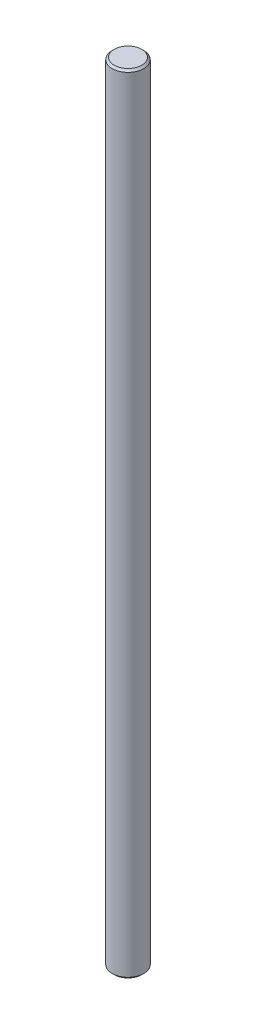
ISO-10303-21;
HEADER;
FILE_DESCRIPTION(('STEP AP214'),'2;1');
FILE_NAME('part.step','',(''),(''),'','','');
FILE_SCHEMA(('AUTOMOTIVE_DESIGN { 1 0 10303 214 1 1 1 1 }'));
ENDSEC;
DATA;
#1=APPLICATION_CONTEXT('core data for automotive mechanical design processes');
#2=APPLICATION_PROTOCOL_DEFINITION('international standard','automotive_design',2000,#1);
#3=PRODUCT_CONTEXT('',#1,'mechanical');
#4=PRODUCT('Part','Part','',(#3));
#5=PRODUCT_RELATED_PRODUCT_CATEGORY('part','',(#4));
#6=PRODUCT_DEFINITION_FORMATION('','',#4);
#7=PRODUCT_DEFINITION_CONTEXT('part definition',#1,'design');
#8=PRODUCT_DEFINITION('design','',#6,#7);
#9=PRODUCT_DEFINITION_SHAPE('','',#8);
#10=(LENGTH_UNIT() NAMED_UNIT(*) SI_UNIT(.MILLI.,.METRE.));
#11=(NAMED_UNIT(*) PLANE_ANGLE_UNIT() SI_UNIT($,.RADIAN.));
#12=(NAMED_UNIT(*) SI_UNIT($,.STERADIAN.) SOLID_ANGLE_UNIT());
#13=UNCERTAINTY_MEASURE_WITH_UNIT(LENGTH_MEASURE(1.E-05),#10,'distance_accuracy_value','');
#14=(GEOMETRIC_REPRESENTATION_CONTEXT(3) GLOBAL_UNCERTAINTY_ASSIGNED_CONTEXT((#13)) GLOBAL_UNIT_ASSIGNED_CONTEXT((#10,
#11,#12)) REPRESENTATION_CONTEXT('',''));
#15=CARTESIAN_POINT('',(0.,0.,0.));
#16=DIRECTION('',(0.,0.,1.));
#17=DIRECTION('',(1.,0.,0.));
#18=AXIS2_PLACEMENT_3D('',#15,#16,#17);
#19=CARTESIAN_POINT('',(0.,50.,0.));
#20=DIRECTION('',(0.,-1.,0.));
#21=DIRECTION('',(0.,0.,-1.));
#22=AXIS2_PLACEMENT_3D('',#19,#20,#21);
#23=CYLINDRICAL_SURFACE('',#22,2.);
#24=CARTESIAN_POINT('',(0.,-49.75,0.));
#25=DIRECTION('',(0.,1.,0.));
#26=DIRECTION('',(0.,0.,1.));
#27=AXIS2_PLACEMENT_3D('',#24,#25,#26);
#28=CIRCLE('',#27,2.);
#29=CARTESIAN_POINT('',(0.,-49.75,2.));
#30=VERTEX_POINT('',#29);
#31=EDGE_CURVE('E57',#30,#30,#28,.T.);
#32=ORIENTED_EDGE('',*,*,#31,.T.);
#33=EDGE_LOOP('',(#32));
#34=FACE_BOUND('',#33,.T.);
#35=CARTESIAN_POINT('',(0.,49.75,0.));
#36=DIRECTION('',(0.,1.,0.));
#37=DIRECTION('',(0.,0.,1.));
#38=AXIS2_PLACEMENT_3D('',#35,#36,#37);
#39=CIRCLE('',#38,2.);
#40=CARTESIAN_POINT('',(0.,49.75,2.));
#41=VERTEX_POINT('',#40);
#42=EDGE_CURVE('E62',#41,#41,#39,.F.);
#43=ORIENTED_EDGE('',*,*,#42,.T.);
#44=EDGE_LOOP('',(#43));
#45=FACE_BOUND('',#44,.T.);
#46=ADVANCED_FACE('F43',(#34,#45),#23,.T.);
#47=CARTESIAN_POINT('',(0.,50.,0.));
#48=DIRECTION('',(0.,1.,0.));
#49=DIRECTION('',(0.,0.,1.));
#50=AXIS2_PLACEMENT_3D('',#47,#48,#49);
#51=PLANE('',#50);
#52=CARTESIAN_POINT('',(0.,50.,0.));
#53=DIRECTION('',(0.,1.,0.));
#54=DIRECTION('',(0.,0.,1.));
#55=AXIS2_PLACEMENT_3D('',#52,#53,#54);
#56=CIRCLE('',#55,1.75);
#57=CARTESIAN_POINT('',(0.,50.,1.75));
#58=VERTEX_POINT('',#57);
#59=EDGE_CURVE('E10',#58,#58,#56,.T.);
#60=ORIENTED_EDGE('',*,*,#59,.T.);
#61=EDGE_LOOP('',(#60));
#62=FACE_BOUND('',#61,.T.);
#63=ADVANCED_FACE('F79',(#62),#51,.T.);
#64=CARTESIAN_POINT('',(0.,-50.,0.));
#65=DIRECTION('',(0.,1.,0.));
#66=DIRECTION('',(0.,0.,1.));
#67=AXIS2_PLACEMENT_3D('',#64,#65,#66);
#68=PLANE('',#67);
#69=CARTESIAN_POINT('',(0.,-50.,0.));
#70=DIRECTION('',(0.,1.,0.));
#71=DIRECTION('',(0.,0.,1.));
#72=AXIS2_PLACEMENT_3D('',#69,#70,#71);
#73=CIRCLE('',#72,1.75);
#74=CARTESIAN_POINT('',(0.,-50.,1.75));
#75=VERTEX_POINT('',#74);
#76=EDGE_CURVE('E52',#75,#75,#73,.F.);
#77=ORIENTED_EDGE('',*,*,#76,.T.);
#78=EDGE_LOOP('',(#77));
#79=FACE_BOUND('',#78,.T.);
#80=ADVANCED_FACE('F76',(#79),#68,.F.);
#81=CARTESIAN_POINT('',(0.,-49.75,0.));
#82=DIRECTION('',(0.,1.,0.));
#83=DIRECTION('',(0.,0.,1.));
#84=AXIS2_PLACEMENT_3D('',#81,#82,#83);
#85=CONICAL_SURFACE('',#84,2.,0.785398163397445);
#86=ORIENTED_EDGE('',*,*,#76,.F.);
#87=EDGE_LOOP('',(#86));
#88=FACE_BOUND('',#87,.T.);
#89=ORIENTED_EDGE('',*,*,#31,.F.);
#90=EDGE_LOOP('',(#89));
#91=FACE_BOUND('',#90,.T.);
#92=ADVANCED_FACE('F72',(#88,#91),#85,.T.);
#93=CARTESIAN_POINT('',(0.,50.,0.));
#94=DIRECTION('',(0.,-1.,0.));
#95=DIRECTION('',(0.,0.,-1.));
#96=AXIS2_PLACEMENT_3D('',#93,#94,#95);
#97=CONICAL_SURFACE('',#96,1.75,0.785398163397459);
#98=ORIENTED_EDGE('',*,*,#42,.F.);
#99=EDGE_LOOP('',(#98));
#100=FACE_BOUND('',#99,.T.);
#101=ORIENTED_EDGE('',*,*,#59,.F.);
#102=EDGE_LOOP('',(#101));
#103=FACE_BOUND('',#102,.T.);
#104=ADVANCED_FACE('F46',(#100,#103),#97,.T.);
#105=CLOSED_SHELL('',(#46,#63,#80,#92,#104));
#106=MANIFOLD_SOLID_BREP('B2',#105);
#107=ADVANCED_BREP_SHAPE_REPRESENTATION('',(#18,#106),#14);
#108=SHAPE_DEFINITION_REPRESENTATION(#9,#107);
ENDSEC;
END-ISO-10303-21;
